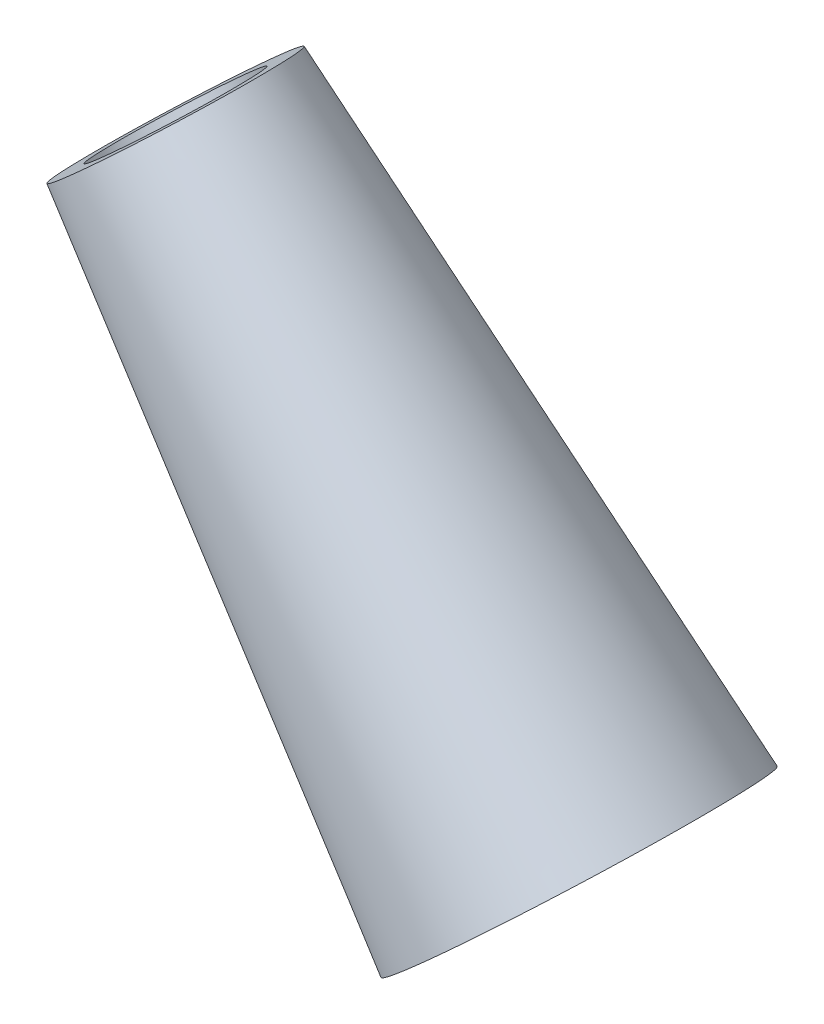
ISO-10303-21;
HEADER;
FILE_DESCRIPTION(('STEP AP214'),'2;1');
FILE_NAME('part.step','',(''),(''),'','','');
FILE_SCHEMA(('AUTOMOTIVE_DESIGN { 1 0 10303 214 1 1 1 1 }'));
ENDSEC;
DATA;
#1=APPLICATION_CONTEXT('core data for automotive mechanical design processes');
#2=APPLICATION_PROTOCOL_DEFINITION('international standard','automotive_design',2000,#1);
#3=PRODUCT_CONTEXT('',#1,'mechanical');
#4=PRODUCT('Part','Part','',(#3));
#5=PRODUCT_RELATED_PRODUCT_CATEGORY('part','',(#4));
#6=PRODUCT_DEFINITION_FORMATION('','',#4);
#7=PRODUCT_DEFINITION_CONTEXT('part definition',#1,'design');
#8=PRODUCT_DEFINITION('design','',#6,#7);
#9=PRODUCT_DEFINITION_SHAPE('','',#8);
#10=(LENGTH_UNIT() NAMED_UNIT(*) SI_UNIT(.MILLI.,.METRE.));
#11=(NAMED_UNIT(*) PLANE_ANGLE_UNIT() SI_UNIT($,.RADIAN.));
#12=(NAMED_UNIT(*) SI_UNIT($,.STERADIAN.) SOLID_ANGLE_UNIT());
#13=UNCERTAINTY_MEASURE_WITH_UNIT(LENGTH_MEASURE(1.E-05),#10,'distance_accuracy_value','');
#14=(GEOMETRIC_REPRESENTATION_CONTEXT(3) GLOBAL_UNCERTAINTY_ASSIGNED_CONTEXT((#13)) GLOBAL_UNIT_ASSIGNED_CONTEXT((#10,
#11,#12)) REPRESENTATION_CONTEXT('',''));
#15=CARTESIAN_POINT('',(0.,0.,0.));
#16=DIRECTION('',(0.,0.,1.));
#17=DIRECTION('',(1.,0.,0.));
#18=AXIS2_PLACEMENT_3D('',#15,#16,#17);
#19=CARTESIAN_POINT('',(85.4434528622897,-32.8876519233619,-23.4209498138876));
#20=DIRECTION('',(0.664699798962186,-0.747110552234159,0.));
#21=DIRECTION('',(0.747110552234159,0.664699798962186,0.));
#22=AXIS2_PLACEMENT_3D('',#19,#20,#21);
#23=PLANE('',#22);
#24=CARTESIAN_POINT('',(86.6664044169407,-31.7995992247536,-27.368377284982));
#25=DIRECTION('',(0.664699798962185,-0.747110552234159,0.));
#26=DIRECTION('',(0.747110552234159,0.664699798962185,0.));
#27=AXIS2_PLACEMENT_3D('',#24,#25,#26);
#28=CIRCLE('',#27,2.3495);
#29=CARTESIAN_POINT('',(88.4217406594148,-30.237887047092,-27.368377284982));
#30=VERTEX_POINT('',#29);
#31=EDGE_CURVE('E17',#30,#30,#28,.F.);
#32=ORIENTED_EDGE('',*,*,#31,.T.);
#33=EDGE_LOOP('',(#32));
#34=FACE_BOUND('',#33,.T.);
#35=CARTESIAN_POINT('',(86.6664044169406,-31.7995992247536,-27.368377284982));
#36=DIRECTION('',(0.664699798962186,-0.747110552234159,0.));
#37=DIRECTION('',(0.747110552234159,0.664699798962186,0.));
#38=AXIS2_PLACEMENT_3D('',#35,#36,#37);
#39=CIRCLE('',#38,4.27336551438365);
#40=CARTESIAN_POINT('',(89.8590808862902,-28.9590940264508,-27.368377284982));
#41=VERTEX_POINT('',#40);
#42=EDGE_CURVE('E33',#41,#41,#39,.T.);
#43=ORIENTED_EDGE('',*,*,#42,.T.);
#44=EDGE_LOOP('',(#43));
#45=FACE_BOUND('',#44,.T.);
#46=ADVANCED_FACE('F14',(#34,#45),#23,.T.);
#47=CARTESIAN_POINT('',(88.363323780256,-33.7069058985375,-27.368377284982));
#48=DIRECTION('',(0.664699798962185,-0.747110552234159,0.));
#49=DIRECTION('',(0.747110552234159,0.664699798962185,0.));
#50=AXIS2_PLACEMENT_3D('',#47,#48,#49);
#51=CYLINDRICAL_SURFACE('',#50,2.3495);
#52=ORIENTED_EDGE('',*,*,#31,.F.);
#53=EDGE_LOOP('',(#52));
#54=FACE_BOUND('',#53,.T.);
#55=CARTESIAN_POINT('',(75.447541986622,-19.1898007580758,-27.368377284982));
#56=DIRECTION('',(0.664699798962185,-0.747110552234159,0.));
#57=DIRECTION('',(0.747110552234159,0.664699798962185,0.));
#58=AXIS2_PLACEMENT_3D('',#55,#56,#57);
#59=CIRCLE('',#58,2.3495);
#60=CARTESIAN_POINT('',(77.2028782290961,-17.6280885804141,-27.368377284982));
#61=VERTEX_POINT('',#60);
#62=EDGE_CURVE('E31',#61,#61,#59,.T.);
#63=ORIENTED_EDGE('',*,*,#62,.F.);
#64=EDGE_LOOP('',(#63));
#65=FACE_BOUND('',#64,.T.);
#66=ADVANCED_FACE('F41',(#54,#65),#51,.F.);
#67=CARTESIAN_POINT('',(88.363323780256,-33.7069058985375,-27.368377284982));
#68=DIRECTION('',(0.664699798962186,-0.747110552234159,0.));
#69=DIRECTION('',(0.747110552234159,0.664699798962186,0.));
#70=AXIS2_PLACEMENT_3D('',#67,#68,#69);
#71=CYLINDRICAL_SURFACE('',#70,4.27336551438365);
#72=CARTESIAN_POINT('',(88.363323780256,-33.7069058985375,-27.368377284982));
#73=DIRECTION('',(0.664699798962186,-0.747110552234159,0.));
#74=DIRECTION('',(0.747110552234159,0.664699798962186,0.));
#75=AXIS2_PLACEMENT_3D('',#72,#73,#74);
#76=CIRCLE('',#75,4.27336551438365);
#77=CARTESIAN_POINT('',(91.5560002496056,-30.8664007002347,-27.368377284982));
#78=VERTEX_POINT('',#77);
#79=EDGE_CURVE('E26',#78,#78,#76,.F.);
#80=ORIENTED_EDGE('',*,*,#79,.F.);
#81=EDGE_LOOP('',(#80));
#82=FACE_BOUND('',#81,.T.);
#83=ORIENTED_EDGE('',*,*,#42,.F.);
#84=EDGE_LOOP('',(#83));
#85=FACE_BOUND('',#84,.T.);
#86=ADVANCED_FACE('F44',(#82,#85),#71,.F.);
#87=CARTESIAN_POINT('',(74.7751621801246,-19.7880130586093,-25.1980782988271));
#88=DIRECTION('',(-0.664699798962186,0.747110552234159,0.));
#89=DIRECTION('',(-0.747110552234159,-0.664699798962186,0.));
#90=AXIS2_PLACEMENT_3D('',#87,#88,#89);
#91=PLANE('',#90);
#92=ORIENTED_EDGE('',*,*,#62,.T.);
#93=EDGE_LOOP('',(#92));
#94=FACE_BOUND('',#93,.T.);
#95=CARTESIAN_POINT('',(75.4475419866178,-19.1898007580711,-27.368377284982));
#96=DIRECTION('',(0.664699798962188,-0.747110552234157,0.));
#97=DIRECTION('',(0.747110552234157,0.664699798962188,0.));
#98=AXIS2_PLACEMENT_3D('',#95,#96,#97);
#99=CIRCLE('',#98,3.30200000004449);
#100=CARTESIAN_POINT('',(77.9145010301282,-16.9949620218684,-27.368377284982));
#101=VERTEX_POINT('',#100);
#102=EDGE_CURVE('E21',#101,#101,#99,.T.);
#103=ORIENTED_EDGE('',*,*,#102,.F.);
#104=EDGE_LOOP('',(#103));
#105=FACE_BOUND('',#104,.T.);
#106=ADVANCED_FACE('F47',(#94,#105),#91,.T.);
#107=CARTESIAN_POINT('',(86.909529604046,-35.0003378996914,-22.6758389365389));
#108=DIRECTION('',(0.664699798962186,-0.747110552234159,0.));
#109=DIRECTION('',(0.747110552234159,0.664699798962186,0.));
#110=AXIS2_PLACEMENT_3D('',#107,#108,#109);
#111=PLANE('',#110);
#112=ORIENTED_EDGE('',*,*,#79,.T.);
#113=EDGE_LOOP('',(#112));
#114=FACE_BOUND('',#113,.T.);
#115=CARTESIAN_POINT('',(88.3633237803937,-33.7069058986923,-27.368377284982));
#116=DIRECTION('',(0.664699798962188,-0.747110552234157,0.));
#117=DIRECTION('',(0.747110552234157,0.664699798962188,0.));
#118=AXIS2_PLACEMENT_3D('',#115,#116,#117);
#119=CIRCLE('',#118,5.08000000006171);
#120=CARTESIAN_POINT('',(92.1586453857893,-30.3302309199233,-27.368377284982));
#121=VERTEX_POINT('',#120);
#122=EDGE_CURVE('E10',#121,#121,#119,.F.);
#123=ORIENTED_EDGE('',*,*,#122,.F.);
#124=EDGE_LOOP('',(#123));
#125=FACE_BOUND('',#124,.T.);
#126=ADVANCED_FACE('F50',(#114,#125),#111,.T.);
#127=CARTESIAN_POINT('',(88.3633237803826,-33.7069058986798,-27.368377284982));
#128=DIRECTION('',(0.664699798962188,-0.747110552234157,0.));
#129=DIRECTION('',(0.747110552234157,0.664699798962188,0.));
#130=AXIS2_PLACEMENT_3D('',#127,#128,#129);
#131=CONICAL_SURFACE('',#130,5.08000000006018,0.0912491623239349);
#132=ORIENTED_EDGE('',*,*,#122,.T.);
#133=EDGE_LOOP('',(#132));
#134=FACE_BOUND('',#133,.T.);
#135=ORIENTED_EDGE('',*,*,#102,.T.);
#136=EDGE_LOOP('',(#135));
#137=FACE_BOUND('',#136,.T.);
#138=ADVANCED_FACE('F54',(#134,#137),#131,.T.);
#139=CLOSED_SHELL('',(#46,#66,#86,#106,#126,#138));
#140=MANIFOLD_SOLID_BREP('B1',#139);
#141=ADVANCED_BREP_SHAPE_REPRESENTATION('',(#18,#140),#14);
#142=SHAPE_DEFINITION_REPRESENTATION(#9,#141);
ENDSEC;
END-ISO-10303-21;
